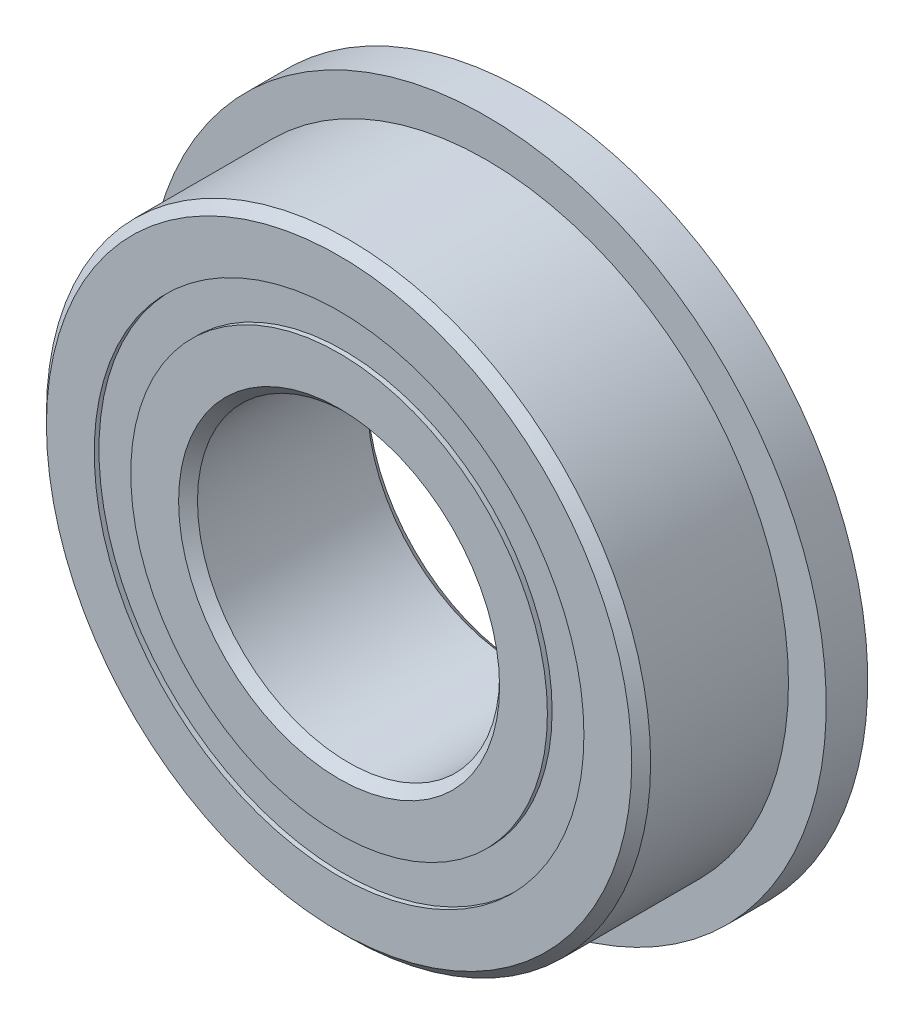
ISO-10303-21;
HEADER;
FILE_DESCRIPTION(('STEP AP214'),'2;1');
FILE_NAME('part.step','',(''),(''),'','','');
FILE_SCHEMA(('AUTOMOTIVE_DESIGN { 1 0 10303 214 1 1 1 1 }'));
ENDSEC;
DATA;
#1=APPLICATION_CONTEXT('core data for automotive mechanical design processes');
#2=APPLICATION_PROTOCOL_DEFINITION('international standard','automotive_design',2000,#1);
#3=PRODUCT_CONTEXT('',#1,'mechanical');
#4=PRODUCT('Part','Part','',(#3));
#5=PRODUCT_RELATED_PRODUCT_CATEGORY('part','',(#4));
#6=PRODUCT_DEFINITION_FORMATION('','',#4);
#7=PRODUCT_DEFINITION_CONTEXT('part definition',#1,'design');
#8=PRODUCT_DEFINITION('design','',#6,#7);
#9=PRODUCT_DEFINITION_SHAPE('','',#8);
#10=(LENGTH_UNIT() NAMED_UNIT(*) SI_UNIT(.MILLI.,.METRE.));
#11=(NAMED_UNIT(*) PLANE_ANGLE_UNIT() SI_UNIT($,.RADIAN.));
#12=(NAMED_UNIT(*) SI_UNIT($,.STERADIAN.) SOLID_ANGLE_UNIT());
#13=UNCERTAINTY_MEASURE_WITH_UNIT(LENGTH_MEASURE(1.E-05),#10,'distance_accuracy_value','');
#14=(GEOMETRIC_REPRESENTATION_CONTEXT(3) GLOBAL_UNCERTAINTY_ASSIGNED_CONTEXT((#13)) GLOBAL_UNIT_ASSIGNED_CONTEXT((#10,
#11,#12)) REPRESENTATION_CONTEXT('',''));
#15=CARTESIAN_POINT('',(0.,0.,0.));
#16=DIRECTION('',(0.,0.,1.));
#17=DIRECTION('',(1.,0.,0.));
#18=AXIS2_PLACEMENT_3D('',#15,#16,#17);
#19=CARTESIAN_POINT('',(0.,6.48351648351648,-2.375));
#20=DIRECTION('',(0.,0.,1.));
#21=DIRECTION('',(1.,0.,0.));
#22=AXIS2_PLACEMENT_3D('',#19,#20,#21);
#23=PLANE('',#22);
#24=CARTESIAN_POINT('',(0.,0.,-2.375));
#25=DIRECTION('',(0.,0.,1.));
#26=DIRECTION('',(1.,0.,0.));
#27=AXIS2_PLACEMENT_3D('',#24,#25,#26);
#28=CIRCLE('',#27,6.48351648351648);
#29=CARTESIAN_POINT('',(6.48351648351648,0.,-2.375));
#30=VERTEX_POINT('',#29);
#31=EDGE_CURVE('E66',#30,#30,#28,.T.);
#32=ORIENTED_EDGE('',*,*,#31,.F.);
#33=EDGE_LOOP('',(#32));
#34=FACE_BOUND('',#33,.T.);
#35=CARTESIAN_POINT('',(0.,0.,-2.375));
#36=DIRECTION('',(0.,0.,1.));
#37=DIRECTION('',(1.,0.,0.));
#38=AXIS2_PLACEMENT_3D('',#35,#36,#37);
#39=CIRCLE('',#38,5.51648351648352);
#40=CARTESIAN_POINT('',(5.51648351648352,0.,-2.375));
#41=VERTEX_POINT('',#40);
#42=EDGE_CURVE('E11',#41,#41,#39,.T.);
#43=ORIENTED_EDGE('',*,*,#42,.T.);
#44=EDGE_LOOP('',(#43));
#45=FACE_BOUND('',#44,.T.);
#46=ADVANCED_FACE('F48',(#34,#45),#23,.F.);
#47=CARTESIAN_POINT('',(0.,0.,2.5));
#48=DIRECTION('',(0.,0.,1.));
#49=DIRECTION('',(1.,0.,0.));
#50=AXIS2_PLACEMENT_3D('',#47,#48,#49);
#51=CYLINDRICAL_SURFACE('',#50,5.51648351648352);
#52=ORIENTED_EDGE('',*,*,#42,.F.);
#53=EDGE_LOOP('',(#52));
#54=FACE_BOUND('',#53,.T.);
#55=CARTESIAN_POINT('',(0.,0.,-1.21175743903915));
#56=DIRECTION('',(0.,0.,1.));
#57=DIRECTION('',(1.,0.,0.));
#58=AXIS2_PLACEMENT_3D('',#55,#56,#57);
#59=CIRCLE('',#58,5.51648351648352);
#60=CARTESIAN_POINT('',(5.51648351648352,0.,-1.21175743903915));
#61=VERTEX_POINT('',#60);
#62=EDGE_CURVE('E55',#61,#61,#59,.T.);
#63=ORIENTED_EDGE('',*,*,#62,.T.);
#64=EDGE_LOOP('',(#63));
#65=FACE_BOUND('',#64,.T.);
#66=ADVANCED_FACE('F75',(#54,#65),#51,.F.);
#67=CARTESIAN_POINT('',(0.,6.48351648351648,-1.21175743903915));
#68=DIRECTION('',(0.,0.,-1.));
#69=DIRECTION('',(-1.,0.,0.));
#70=AXIS2_PLACEMENT_3D('',#67,#68,#69);
#71=PLANE('',#70);
#72=ORIENTED_EDGE('',*,*,#62,.F.);
#73=EDGE_LOOP('',(#72));
#74=FACE_BOUND('',#73,.T.);
#75=CARTESIAN_POINT('',(0.,0.,-1.21175743903915));
#76=DIRECTION('',(0.,0.,1.));
#77=DIRECTION('',(1.,0.,0.));
#78=AXIS2_PLACEMENT_3D('',#75,#76,#77);
#79=CIRCLE('',#78,6.48351648351648);
#80=CARTESIAN_POINT('',(6.48351648351648,0.,-1.21175743903915));
#81=VERTEX_POINT('',#80);
#82=EDGE_CURVE('E62',#81,#81,#79,.T.);
#83=ORIENTED_EDGE('',*,*,#82,.T.);
#84=EDGE_LOOP('',(#83));
#85=FACE_BOUND('',#84,.T.);
#86=ADVANCED_FACE('F79',(#74,#85),#71,.F.);
#87=CARTESIAN_POINT('',(0.,0.,2.5));
#88=DIRECTION('',(0.,0.,1.));
#89=DIRECTION('',(1.,0.,0.));
#90=AXIS2_PLACEMENT_3D('',#87,#88,#89);
#91=CYLINDRICAL_SURFACE('',#90,6.48351648351648);
#92=ORIENTED_EDGE('',*,*,#82,.F.);
#93=EDGE_LOOP('',(#92));
#94=FACE_BOUND('',#93,.T.);
#95=ORIENTED_EDGE('',*,*,#31,.T.);
#96=EDGE_LOOP('',(#95));
#97=FACE_BOUND('',#96,.T.);
#98=ADVANCED_FACE('F72',(#94,#97),#91,.T.);
#99=CLOSED_SHELL('',(#46,#66,#86,#98));
#100=MANIFOLD_SOLID_BREP('B2',#99);
#101=CARTESIAN_POINT('',(0.,6.48351648351648,2.375));
#102=DIRECTION('',(0.,0.,-1.));
#103=DIRECTION('',(-1.,0.,0.));
#104=AXIS2_PLACEMENT_3D('',#101,#102,#103);
#105=PLANE('',#104);
#106=CARTESIAN_POINT('',(0.,0.,2.375));
#107=DIRECTION('',(0.,0.,1.));
#108=DIRECTION('',(1.,0.,0.));
#109=AXIS2_PLACEMENT_3D('',#106,#107,#108);
#110=CIRCLE('',#109,5.51648351648352);
#111=CARTESIAN_POINT('',(5.51648351648352,0.,2.375));
#112=VERTEX_POINT('',#111);
#113=EDGE_CURVE('E47',#112,#112,#110,.T.);
#114=ORIENTED_EDGE('',*,*,#113,.F.);
#115=EDGE_LOOP('',(#114));
#116=FACE_BOUND('',#115,.T.);
#117=CARTESIAN_POINT('',(0.,0.,2.375));
#118=DIRECTION('',(0.,0.,1.));
#119=DIRECTION('',(1.,0.,0.));
#120=AXIS2_PLACEMENT_3D('',#117,#118,#119);
#121=CIRCLE('',#120,6.48351648351648);
#122=CARTESIAN_POINT('',(6.48351648351648,0.,2.375));
#123=VERTEX_POINT('',#122);
#124=EDGE_CURVE('E142',#123,#123,#121,.T.);
#125=ORIENTED_EDGE('',*,*,#124,.T.);
#126=EDGE_LOOP('',(#125));
#127=FACE_BOUND('',#126,.T.);
#128=ADVANCED_FACE('F124',(#116,#127),#105,.F.);
#129=CARTESIAN_POINT('',(0.,0.,2.5));
#130=DIRECTION('',(0.,0.,1.));
#131=DIRECTION('',(1.,0.,0.));
#132=AXIS2_PLACEMENT_3D('',#129,#130,#131);
#133=CYLINDRICAL_SURFACE('',#132,5.51648351648352);
#134=CARTESIAN_POINT('',(0.,0.,1.21175743903915));
#135=DIRECTION('',(0.,0.,1.));
#136=DIRECTION('',(1.,0.,0.));
#137=AXIS2_PLACEMENT_3D('',#134,#135,#136);
#138=CIRCLE('',#137,5.51648351648352);
#139=CARTESIAN_POINT('',(5.51648351648352,0.,1.21175743903915));
#140=VERTEX_POINT('',#139);
#141=EDGE_CURVE('E131',#140,#140,#138,.T.);
#142=ORIENTED_EDGE('',*,*,#141,.F.);
#143=EDGE_LOOP('',(#142));
#144=FACE_BOUND('',#143,.T.);
#145=ORIENTED_EDGE('',*,*,#113,.T.);
#146=EDGE_LOOP('',(#145));
#147=FACE_BOUND('',#146,.T.);
#148=ADVANCED_FACE('F157',(#144,#147),#133,.F.);
#149=CARTESIAN_POINT('',(0.,6.48351648351648,1.21175743903915));
#150=DIRECTION('',(0.,0.,1.));
#151=DIRECTION('',(1.,0.,0.));
#152=AXIS2_PLACEMENT_3D('',#149,#150,#151);
#153=PLANE('',#152);
#154=CARTESIAN_POINT('',(0.,0.,1.21175743903915));
#155=DIRECTION('',(0.,0.,1.));
#156=DIRECTION('',(1.,0.,0.));
#157=AXIS2_PLACEMENT_3D('',#154,#155,#156);
#158=CIRCLE('',#157,6.48351648351648);
#159=CARTESIAN_POINT('',(6.48351648351648,0.,1.21175743903915));
#160=VERTEX_POINT('',#159);
#161=EDGE_CURVE('E137',#160,#160,#158,.T.);
#162=ORIENTED_EDGE('',*,*,#161,.F.);
#163=EDGE_LOOP('',(#162));
#164=FACE_BOUND('',#163,.T.);
#165=ORIENTED_EDGE('',*,*,#141,.T.);
#166=EDGE_LOOP('',(#165));
#167=FACE_BOUND('',#166,.T.);
#168=ADVANCED_FACE('F152',(#164,#167),#153,.F.);
#169=CARTESIAN_POINT('',(0.,0.,2.5));
#170=DIRECTION('',(0.,0.,1.));
#171=DIRECTION('',(1.,0.,0.));
#172=AXIS2_PLACEMENT_3D('',#169,#170,#171);
#173=CYLINDRICAL_SURFACE('',#172,6.48351648351648);
#174=ORIENTED_EDGE('',*,*,#124,.F.);
#175=EDGE_LOOP('',(#174));
#176=FACE_BOUND('',#175,.T.);
#177=ORIENTED_EDGE('',*,*,#161,.T.);
#178=EDGE_LOOP('',(#177));
#179=FACE_BOUND('',#178,.T.);
#180=ADVANCED_FACE('F149',(#176,#179),#173,.T.);
#181=CLOSED_SHELL('',(#128,#148,#168,#180));
#182=MANIFOLD_SOLID_BREP('B6',#181);
#183=CARTESIAN_POINT('',(-2.99999999999993,5.19615242270667,0.));
#184=DIRECTION('',(0.,0.,1.));
#185=DIRECTION('',(-0.499999999999989,0.866025403784445,0.));
#186=AXIS2_PLACEMENT_3D('',#183,#184,#185);
#187=SPHERICAL_SURFACE('',#186,1.21175743903915);
#188=CARTESIAN_POINT('',(-2.99999999999993,5.19615242270667,1.21175743903915));
#189=VERTEX_POINT('',#188);
#190=VERTEX_LOOP('',#189);
#191=FACE_BOUND('',#190,.T.);
#192=ADVANCED_FACE('F200',(#191),#187,.T.);
#193=CLOSED_SHELL('',(#192));
#194=MANIFOLD_SOLID_BREP('B42',#193);
#195=CARTESIAN_POINT('',(-5.1961524227066,3.00000000000006,0.));
#196=DIRECTION('',(0.,0.,1.));
#197=DIRECTION('',(-0.866025403784433,0.50000000000001,0.));
#198=AXIS2_PLACEMENT_3D('',#195,#196,#197);
#199=SPHERICAL_SURFACE('',#198,1.21175743903915);
#200=CARTESIAN_POINT('',(-5.1961524227066,3.00000000000006,1.21175743903915));
#201=VERTEX_POINT('',#200);
#202=VERTEX_LOOP('',#201);
#203=FACE_BOUND('',#202,.T.);
#204=ADVANCED_FACE('F222',(#203),#199,.T.);
#205=CLOSED_SHELL('',(#204));
#206=MANIFOLD_SOLID_BREP('B120',#205);
#207=CARTESIAN_POINT('',(-6.,0.,0.));
#208=DIRECTION('',(0.,0.,1.));
#209=DIRECTION('',(-1.,0.,0.));
#210=AXIS2_PLACEMENT_3D('',#207,#208,#209);
#211=SPHERICAL_SURFACE('',#210,1.21175743903915);
#212=CARTESIAN_POINT('',(-6.,0.,1.21175743903915));
#213=VERTEX_POINT('',#212);
#214=VERTEX_LOOP('',#213);
#215=FACE_BOUND('',#214,.T.);
#216=ADVANCED_FACE('F244',(#215),#211,.T.);
#217=CLOSED_SHELL('',(#216));
#218=MANIFOLD_SOLID_BREP('B196',#217);
#219=CARTESIAN_POINT('',(-5.19615242270666,-2.99999999999995,0.));
#220=DIRECTION('',(0.,0.,1.));
#221=DIRECTION('',(-0.866025403784443,-0.499999999999992,0.));
#222=AXIS2_PLACEMENT_3D('',#219,#220,#221);
#223=SPHERICAL_SURFACE('',#222,1.21175743903915);
#224=CARTESIAN_POINT('',(-5.19615242270666,-2.99999999999995,1.21175743903915));
#225=VERTEX_POINT('',#224);
#226=VERTEX_LOOP('',#225);
#227=FACE_BOUND('',#226,.T.);
#228=ADVANCED_FACE('F265',(#227),#223,.T.);
#229=CLOSED_SHELL('',(#228));
#230=MANIFOLD_SOLID_BREP('B218',#229);
#231=CARTESIAN_POINT('',(-3.00000000000004,-5.19615242270661,0.));
#232=DIRECTION('',(0.,0.,1.));
#233=DIRECTION('',(-0.500000000000007,-0.866025403784435,0.));
#234=AXIS2_PLACEMENT_3D('',#231,#232,#233);
#235=SPHERICAL_SURFACE('',#234,1.21175743903915);
#236=CARTESIAN_POINT('',(-3.00000000000004,-5.19615242270661,1.21175743903915));
#237=VERTEX_POINT('',#236);
#238=VERTEX_LOOP('',#237);
#239=FACE_BOUND('',#238,.T.);
#240=ADVANCED_FACE('F286',(#239),#235,.T.);
#241=CLOSED_SHELL('',(#240));
#242=MANIFOLD_SOLID_BREP('B240',#241);
#243=CARTESIAN_POINT('',(0.,-6.,0.));
#244=DIRECTION('',(0.,0.,1.));
#245=DIRECTION('',(0.,-1.,0.));
#246=AXIS2_PLACEMENT_3D('',#243,#244,#245);
#247=SPHERICAL_SURFACE('',#246,1.21175743903915);
#248=CARTESIAN_POINT('',(0.,-6.,1.21175743903915));
#249=VERTEX_POINT('',#248);
#250=VERTEX_LOOP('',#249);
#251=FACE_BOUND('',#250,.T.);
#252=ADVANCED_FACE('F307',(#251),#247,.T.);
#253=CLOSED_SHELL('',(#252));
#254=MANIFOLD_SOLID_BREP('B261',#253);
#255=CARTESIAN_POINT('',(2.99999999999997,-5.19615242270665,0.));
#256=DIRECTION('',(0.,0.,1.));
#257=DIRECTION('',(0.499999999999995,-0.866025403784442,0.));
#258=AXIS2_PLACEMENT_3D('',#255,#256,#257);
#259=SPHERICAL_SURFACE('',#258,1.21175743903915);
#260=CARTESIAN_POINT('',(2.99999999999997,-5.19615242270665,1.21175743903915));
#261=VERTEX_POINT('',#260);
#262=VERTEX_LOOP('',#261);
#263=FACE_BOUND('',#262,.T.);
#264=ADVANCED_FACE('F328',(#263),#259,.T.);
#265=CLOSED_SHELL('',(#264));
#266=MANIFOLD_SOLID_BREP('B282',#265);
#267=CARTESIAN_POINT('',(5.19615242270662,-3.00000000000002,0.));
#268=DIRECTION('',(0.,0.,1.));
#269=DIRECTION('',(0.866025403784436,-0.500000000000004,0.));
#270=AXIS2_PLACEMENT_3D('',#267,#268,#269);
#271=SPHERICAL_SURFACE('',#270,1.21175743903915);
#272=CARTESIAN_POINT('',(5.19615242270662,-3.00000000000002,1.21175743903915));
#273=VERTEX_POINT('',#272);
#274=VERTEX_LOOP('',#273);
#275=FACE_BOUND('',#274,.T.);
#276=ADVANCED_FACE('F349',(#275),#271,.T.);
#277=CLOSED_SHELL('',(#276));
#278=MANIFOLD_SOLID_BREP('B303',#277);
#279=CARTESIAN_POINT('',(6.,0.,0.));
#280=DIRECTION('',(0.,0.,1.));
#281=DIRECTION('',(1.,0.,0.));
#282=AXIS2_PLACEMENT_3D('',#279,#280,#281);
#283=SPHERICAL_SURFACE('',#282,1.21175743903915);
#284=CARTESIAN_POINT('',(6.,0.,1.21175743903915));
#285=VERTEX_POINT('',#284);
#286=VERTEX_LOOP('',#285);
#287=FACE_BOUND('',#286,.T.);
#288=ADVANCED_FACE('F371',(#287),#283,.T.);
#289=CLOSED_SHELL('',(#288));
#290=MANIFOLD_SOLID_BREP('B324',#289);
#291=CARTESIAN_POINT('',(5.19615242270664,2.99999999999999,0.));
#292=DIRECTION('',(0.,0.,1.));
#293=DIRECTION('',(0.86602540378444,0.499999999999998,0.));
#294=AXIS2_PLACEMENT_3D('',#291,#292,#293);
#295=SPHERICAL_SURFACE('',#294,1.21175743903915);
#296=CARTESIAN_POINT('',(5.19615242270664,2.99999999999999,1.21175743903915));
#297=VERTEX_POINT('',#296);
#298=VERTEX_LOOP('',#297);
#299=FACE_BOUND('',#298,.T.);
#300=ADVANCED_FACE('F393',(#299),#295,.T.);
#301=CLOSED_SHELL('',(#300));
#302=MANIFOLD_SOLID_BREP('B345',#301);
#303=CARTESIAN_POINT('',(3.00000000000001,5.19615242270663,0.));
#304=DIRECTION('',(0.,0.,1.));
#305=DIRECTION('',(0.500000000000001,0.866025403784438,0.));
#306=AXIS2_PLACEMENT_3D('',#303,#304,#305);
#307=SPHERICAL_SURFACE('',#306,1.21175743903915);
#308=CARTESIAN_POINT('',(3.00000000000001,5.19615242270663,1.21175743903915));
#309=VERTEX_POINT('',#308);
#310=VERTEX_LOOP('',#309);
#311=FACE_BOUND('',#310,.T.);
#312=ADVANCED_FACE('F414',(#311),#307,.T.);
#313=CLOSED_SHELL('',(#312));
#314=MANIFOLD_SOLID_BREP('B367',#313);
#315=CARTESIAN_POINT('',(0.,6.,0.));
#316=DIRECTION('',(0.,0.,1.));
#317=DIRECTION('',(0.,1.,0.));
#318=AXIS2_PLACEMENT_3D('',#315,#316,#317);
#319=SPHERICAL_SURFACE('',#318,1.21175743903915);
#320=CARTESIAN_POINT('',(0.,6.,1.21175743903915));
#321=VERTEX_POINT('',#320);
#322=VERTEX_LOOP('',#321);
#323=FACE_BOUND('',#322,.T.);
#324=ADVANCED_FACE('F437',(#323),#319,.T.);
#325=CLOSED_SHELL('',(#324));
#326=MANIFOLD_SOLID_BREP('B389',#325);
#327=CARTESIAN_POINT('',(0.,5.51648351648352,2.5));
#328=DIRECTION('',(0.,0.,-1.));
#329=DIRECTION('',(-1.,0.,0.));
#330=AXIS2_PLACEMENT_3D('',#327,#328,#329);
#331=PLANE('',#330);
#332=CARTESIAN_POINT('',(0.,0.,2.5));
#333=DIRECTION('',(0.,0.,1.));
#334=DIRECTION('',(1.,0.,0.));
#335=AXIS2_PLACEMENT_3D('',#332,#333,#334);
#336=CIRCLE('',#335,4.25);
#337=CARTESIAN_POINT('',(4.25,0.,2.5));
#338=VERTEX_POINT('',#337);
#339=EDGE_CURVE('E493',#338,#338,#336,.T.);
#340=ORIENTED_EDGE('',*,*,#339,.F.);
#341=EDGE_LOOP('',(#340));
#342=FACE_BOUND('',#341,.T.);
#343=CARTESIAN_POINT('',(0.,0.,2.5));
#344=DIRECTION('',(0.,0.,1.));
#345=DIRECTION('',(1.,0.,0.));
#346=AXIS2_PLACEMENT_3D('',#343,#344,#345);
#347=CIRCLE('',#346,5.51648351648352);
#348=CARTESIAN_POINT('',(5.51648351648352,0.,2.5));
#349=VERTEX_POINT('',#348);
#350=EDGE_CURVE('E436',#349,#349,#347,.T.);
#351=ORIENTED_EDGE('',*,*,#350,.T.);
#352=EDGE_LOOP('',(#351));
#353=FACE_BOUND('',#352,.T.);
#354=ADVANCED_FACE('F457',(#342,#353),#331,.F.);
#355=CARTESIAN_POINT('',(0.,0.,2.5));
#356=DIRECTION('',(0.,0.,1.));
#357=DIRECTION('',(1.,0.,0.));
#358=AXIS2_PLACEMENT_3D('',#355,#356,#357);
#359=CYLINDRICAL_SURFACE('',#358,5.51648351648352);
#360=ORIENTED_EDGE('',*,*,#350,.F.);
#361=EDGE_LOOP('',(#360));
#362=FACE_BOUND('',#361,.T.);
#363=CARTESIAN_POINT('',(0.,0.,1.11111111111111));
#364=DIRECTION('',(0.,0.,1.));
#365=DIRECTION('',(1.,0.,0.));
#366=AXIS2_PLACEMENT_3D('',#363,#364,#365);
#367=CIRCLE('',#366,5.51648351648352);
#368=CARTESIAN_POINT('',(5.51648351648352,0.,1.11111111111111));
#369=VERTEX_POINT('',#368);
#370=EDGE_CURVE('E464',#369,#369,#367,.T.);
#371=ORIENTED_EDGE('',*,*,#370,.T.);
#372=EDGE_LOOP('',(#371));
#373=FACE_BOUND('',#372,.T.);
#374=ADVANCED_FACE('F500',(#362,#373),#359,.T.);
#375=CARTESIAN_POINT('',(0.,0.,0.));
#376=DIRECTION('',(0.,0.,1.));
#377=DIRECTION('',(1.,0.,0.));
#378=AXIS2_PLACEMENT_3D('',#375,#376,#377);
#379=TOROIDAL_SURFACE('',#378,6.,1.21175743903915);
#380=ORIENTED_EDGE('',*,*,#370,.F.);
#381=EDGE_LOOP('',(#380));
#382=FACE_BOUND('',#381,.T.);
#383=CARTESIAN_POINT('',(0.,0.,-1.11111111111111));
#384=DIRECTION('',(0.,0.,1.));
#385=DIRECTION('',(1.,0.,0.));
#386=AXIS2_PLACEMENT_3D('',#383,#384,#385);
#387=CIRCLE('',#386,5.51648351648352);
#388=CARTESIAN_POINT('',(5.51648351648352,0.,-1.11111111111111));
#389=VERTEX_POINT('',#388);
#390=EDGE_CURVE('E471',#389,#389,#387,.T.);
#391=ORIENTED_EDGE('',*,*,#390,.T.);
#392=EDGE_LOOP('',(#391));
#393=FACE_BOUND('',#392,.T.);
#394=ADVANCED_FACE('F504',(#382,#393),#379,.F.);
#395=CARTESIAN_POINT('',(0.,0.,2.5));
#396=DIRECTION('',(0.,0.,1.));
#397=DIRECTION('',(1.,0.,0.));
#398=AXIS2_PLACEMENT_3D('',#395,#396,#397);
#399=CYLINDRICAL_SURFACE('',#398,5.51648351648352);
#400=ORIENTED_EDGE('',*,*,#390,.F.);
#401=EDGE_LOOP('',(#400));
#402=FACE_BOUND('',#401,.T.);
#403=CARTESIAN_POINT('',(0.,0.,-2.5));
#404=DIRECTION('',(0.,0.,1.));
#405=DIRECTION('',(1.,0.,0.));
#406=AXIS2_PLACEMENT_3D('',#403,#404,#405);
#407=CIRCLE('',#406,5.51648351648352);
#408=CARTESIAN_POINT('',(5.51648351648352,0.,-2.5));
#409=VERTEX_POINT('',#408);
#410=EDGE_CURVE('E477',#409,#409,#407,.T.);
#411=ORIENTED_EDGE('',*,*,#410,.T.);
#412=EDGE_LOOP('',(#411));
#413=FACE_BOUND('',#412,.T.);
#414=ADVANCED_FACE('F509',(#402,#413),#399,.T.);
#415=CARTESIAN_POINT('',(0.,4.25,-2.5));
#416=DIRECTION('',(0.,0.,1.));
#417=DIRECTION('',(1.,0.,0.));
#418=AXIS2_PLACEMENT_3D('',#415,#416,#417);
#419=PLANE('',#418);
#420=ORIENTED_EDGE('',*,*,#410,.F.);
#421=EDGE_LOOP('',(#420));
#422=FACE_BOUND('',#421,.T.);
#423=CARTESIAN_POINT('',(0.,0.,-2.5));
#424=DIRECTION('',(0.,0.,1.));
#425=DIRECTION('',(1.,0.,0.));
#426=AXIS2_PLACEMENT_3D('',#423,#424,#425);
#427=CIRCLE('',#426,4.25);
#428=CARTESIAN_POINT('',(4.25,0.,-2.5));
#429=VERTEX_POINT('',#428);
#430=EDGE_CURVE('E483',#429,#429,#427,.T.);
#431=ORIENTED_EDGE('',*,*,#430,.T.);
#432=EDGE_LOOP('',(#431));
#433=FACE_BOUND('',#432,.T.);
#434=ADVANCED_FACE('F515',(#422,#433),#419,.F.);
#435=CARTESIAN_POINT('',(0.,0.,-2.25));
#436=DIRECTION('',(0.,0.,-1.));
#437=DIRECTION('',(-1.,0.,0.));
#438=AXIS2_PLACEMENT_3D('',#435,#436,#437);
#439=CONICAL_SURFACE('',#438,4.,0.785398163397443);
#440=ORIENTED_EDGE('',*,*,#430,.F.);
#441=EDGE_LOOP('',(#440));
#442=FACE_BOUND('',#441,.T.);
#443=CARTESIAN_POINT('',(0.,0.,-2.25));
#444=DIRECTION('',(0.,0.,1.));
#445=DIRECTION('',(1.,0.,0.));
#446=AXIS2_PLACEMENT_3D('',#443,#444,#445);
#447=CIRCLE('',#446,4.);
#448=CARTESIAN_POINT('',(4.,0.,-2.25));
#449=VERTEX_POINT('',#448);
#450=EDGE_CURVE('E487',#449,#449,#447,.T.);
#451=ORIENTED_EDGE('',*,*,#450,.T.);
#452=EDGE_LOOP('',(#451));
#453=FACE_BOUND('',#452,.T.);
#454=ADVANCED_FACE('F519',(#442,#453),#439,.F.);
#455=CARTESIAN_POINT('',(0.,0.,2.5));
#456=DIRECTION('',(0.,0.,1.));
#457=DIRECTION('',(1.,0.,0.));
#458=AXIS2_PLACEMENT_3D('',#455,#456,#457);
#459=CYLINDRICAL_SURFACE('',#458,4.);
#460=ORIENTED_EDGE('',*,*,#450,.F.);
#461=EDGE_LOOP('',(#460));
#462=FACE_BOUND('',#461,.T.);
#463=CARTESIAN_POINT('',(0.,0.,2.25));
#464=DIRECTION('',(0.,0.,1.));
#465=DIRECTION('',(1.,0.,0.));
#466=AXIS2_PLACEMENT_3D('',#463,#464,#465);
#467=CIRCLE('',#466,4.);
#468=CARTESIAN_POINT('',(4.,0.,2.25));
#469=VERTEX_POINT('',#468);
#470=EDGE_CURVE('E490',#469,#469,#467,.T.);
#471=ORIENTED_EDGE('',*,*,#470,.T.);
#472=EDGE_LOOP('',(#471));
#473=FACE_BOUND('',#472,.T.);
#474=ADVANCED_FACE('F523',(#462,#473),#459,.F.);
#475=CARTESIAN_POINT('',(0.,0.,2.5));
#476=DIRECTION('',(0.,0.,1.));
#477=DIRECTION('',(1.,0.,0.));
#478=AXIS2_PLACEMENT_3D('',#475,#476,#477);
#479=CONICAL_SURFACE('',#478,4.25,0.785398163397455);
#480=ORIENTED_EDGE('',*,*,#470,.F.);
#481=EDGE_LOOP('',(#480));
#482=FACE_BOUND('',#481,.T.);
#483=ORIENTED_EDGE('',*,*,#339,.T.);
#484=EDGE_LOOP('',(#483));
#485=FACE_BOUND('',#484,.T.);
#486=ADVANCED_FACE('F497',(#482,#485),#479,.F.);
#487=CLOSED_SHELL('',(#354,#374,#394,#414,#434,#454,#474,#486));
#488=MANIFOLD_SOLID_BREP('B410',#487);
#489=CARTESIAN_POINT('',(0.,0.,2.25));
#490=DIRECTION('',(0.,0.,-1.));
#491=DIRECTION('',(-1.,0.,0.));
#492=AXIS2_PLACEMENT_3D('',#489,#490,#491);
#493=CONICAL_SURFACE('',#492,8.,0.785398163397446);
#494=CARTESIAN_POINT('',(0.,0.,2.5));
#495=DIRECTION('',(0.,0.,1.));
#496=DIRECTION('',(1.,0.,0.));
#497=AXIS2_PLACEMENT_3D('',#494,#495,#496);
#498=CIRCLE('',#497,7.75);
#499=CARTESIAN_POINT('',(7.75,0.,2.5));
#500=VERTEX_POINT('',#499);
#501=EDGE_CURVE('E622',#500,#500,#498,.T.);
#502=ORIENTED_EDGE('',*,*,#501,.F.);
#503=EDGE_LOOP('',(#502));
#504=FACE_BOUND('',#503,.T.);
#505=CARTESIAN_POINT('',(0.,0.,2.25));
#506=DIRECTION('',(0.,0.,1.));
#507=DIRECTION('',(1.,0.,0.));
#508=AXIS2_PLACEMENT_3D('',#505,#506,#507);
#509=CIRCLE('',#508,8.);
#510=CARTESIAN_POINT('',(8.,0.,2.25));
#511=VERTEX_POINT('',#510);
#512=EDGE_CURVE('E456',#511,#511,#509,.T.);
#513=ORIENTED_EDGE('',*,*,#512,.T.);
#514=EDGE_LOOP('',(#513));
#515=FACE_BOUND('',#514,.T.);
#516=ADVANCED_FACE('F594',(#504,#515),#493,.T.);
#517=CARTESIAN_POINT('',(0.,0.,2.5));
#518=DIRECTION('',(0.,0.,1.));
#519=DIRECTION('',(1.,0.,0.));
#520=AXIS2_PLACEMENT_3D('',#517,#518,#519);
#521=CYLINDRICAL_SURFACE('',#520,8.);
#522=CARTESIAN_POINT('',(0.,0.,-1.4));
#523=DIRECTION('',(0.,0.,1.));
#524=DIRECTION('',(1.,0.,0.));
#525=AXIS2_PLACEMENT_3D('',#522,#523,#524);
#526=CIRCLE('',#525,8.);
#527=CARTESIAN_POINT('',(8.,0.,-1.4));
#528=VERTEX_POINT('',#527);
#529=EDGE_CURVE('E626',#528,#528,#526,.T.);
#530=ORIENTED_EDGE('',*,*,#529,.T.);
#531=EDGE_LOOP('',(#530));
#532=FACE_BOUND('',#531,.T.);
#533=ORIENTED_EDGE('',*,*,#512,.F.);
#534=EDGE_LOOP('',(#533));
#535=FACE_BOUND('',#534,.T.);
#536=ADVANCED_FACE('F648',(#532,#535),#521,.T.);
#537=CARTESIAN_POINT('',(0.,7.75,-2.5));
#538=DIRECTION('',(0.,0.,1.));
#539=DIRECTION('',(1.,0.,0.));
#540=AXIS2_PLACEMENT_3D('',#537,#538,#539);
#541=PLANE('',#540);
#542=CARTESIAN_POINT('',(0.,0.,-2.5));
#543=DIRECTION('',(0.,0.,1.));
#544=DIRECTION('',(1.,0.,0.));
#545=AXIS2_PLACEMENT_3D('',#542,#543,#544);
#546=CIRCLE('',#545,6.48351648351648);
#547=CARTESIAN_POINT('',(6.48351648351648,0.,-2.5));
#548=VERTEX_POINT('',#547);
#549=EDGE_CURVE('E601',#548,#548,#546,.T.);
#550=ORIENTED_EDGE('',*,*,#549,.T.);
#551=EDGE_LOOP('',(#550));
#552=FACE_BOUND('',#551,.T.);
#553=CARTESIAN_POINT('',(0.,0.,-2.5));
#554=DIRECTION('',(0.,0.,-1.));
#555=DIRECTION('',(-1.,0.,0.));
#556=AXIS2_PLACEMENT_3D('',#553,#554,#555);
#557=CIRCLE('',#556,9.);
#558=CARTESIAN_POINT('',(-9.,0.,-2.5));
#559=VERTEX_POINT('',#558);
#560=EDGE_CURVE('E629',#559,#559,#557,.T.);
#561=ORIENTED_EDGE('',*,*,#560,.T.);
#562=EDGE_LOOP('',(#561));
#563=FACE_BOUND('',#562,.T.);
#564=ADVANCED_FACE('F651',(#552,#563),#541,.F.);
#565=CARTESIAN_POINT('',(0.,0.,2.5));
#566=DIRECTION('',(0.,0.,1.));
#567=DIRECTION('',(1.,0.,0.));
#568=AXIS2_PLACEMENT_3D('',#565,#566,#567);
#569=CYLINDRICAL_SURFACE('',#568,6.48351648351648);
#570=CARTESIAN_POINT('',(0.,0.,-1.11111111111111));
#571=DIRECTION('',(0.,0.,1.));
#572=DIRECTION('',(1.,0.,0.));
#573=AXIS2_PLACEMENT_3D('',#570,#571,#572);
#574=CIRCLE('',#573,6.48351648351648);
#575=CARTESIAN_POINT('',(6.48351648351648,0.,-1.11111111111111));
#576=VERTEX_POINT('',#575);
#577=EDGE_CURVE('E607',#576,#576,#574,.T.);
#578=ORIENTED_EDGE('',*,*,#577,.T.);
#579=EDGE_LOOP('',(#578));
#580=FACE_BOUND('',#579,.T.);
#581=ORIENTED_EDGE('',*,*,#549,.F.);
#582=EDGE_LOOP('',(#581));
#583=FACE_BOUND('',#582,.T.);
#584=ADVANCED_FACE('F656',(#580,#583),#569,.F.);
#585=CARTESIAN_POINT('',(0.,0.,0.));
#586=DIRECTION('',(0.,0.,1.));
#587=DIRECTION('',(1.,0.,0.));
#588=AXIS2_PLACEMENT_3D('',#585,#586,#587);
#589=TOROIDAL_SURFACE('',#588,6.,1.21175743903915);
#590=ORIENTED_EDGE('',*,*,#577,.F.);
#591=EDGE_LOOP('',(#590));
#592=FACE_BOUND('',#591,.T.);
#593=CARTESIAN_POINT('',(0.,0.,1.11111111111111));
#594=DIRECTION('',(0.,0.,1.));
#595=DIRECTION('',(1.,0.,0.));
#596=AXIS2_PLACEMENT_3D('',#593,#594,#595);
#597=CIRCLE('',#596,6.48351648351648);
#598=CARTESIAN_POINT('',(6.48351648351648,0.,1.11111111111111));
#599=VERTEX_POINT('',#598);
#600=EDGE_CURVE('E612',#599,#599,#597,.T.);
#601=ORIENTED_EDGE('',*,*,#600,.T.);
#602=EDGE_LOOP('',(#601));
#603=FACE_BOUND('',#602,.T.);
#604=ADVANCED_FACE('F662',(#592,#603),#589,.F.);
#605=CARTESIAN_POINT('',(0.,0.,2.5));
#606=DIRECTION('',(0.,0.,1.));
#607=DIRECTION('',(1.,0.,0.));
#608=AXIS2_PLACEMENT_3D('',#605,#606,#607);
#609=CYLINDRICAL_SURFACE('',#608,6.48351648351648);
#610=ORIENTED_EDGE('',*,*,#600,.F.);
#611=EDGE_LOOP('',(#610));
#612=FACE_BOUND('',#611,.T.);
#613=CARTESIAN_POINT('',(0.,0.,2.5));
#614=DIRECTION('',(0.,0.,1.));
#615=DIRECTION('',(1.,0.,0.));
#616=AXIS2_PLACEMENT_3D('',#613,#614,#615);
#617=CIRCLE('',#616,6.48351648351648);
#618=CARTESIAN_POINT('',(6.48351648351648,0.,2.5));
#619=VERTEX_POINT('',#618);
#620=EDGE_CURVE('E618',#619,#619,#617,.T.);
#621=ORIENTED_EDGE('',*,*,#620,.T.);
#622=EDGE_LOOP('',(#621));
#623=FACE_BOUND('',#622,.T.);
#624=ADVANCED_FACE('F666',(#612,#623),#609,.F.);
#625=CARTESIAN_POINT('',(0.,7.75,2.5));
#626=DIRECTION('',(0.,0.,-1.));
#627=DIRECTION('',(-1.,0.,0.));
#628=AXIS2_PLACEMENT_3D('',#625,#626,#627);
#629=PLANE('',#628);
#630=ORIENTED_EDGE('',*,*,#620,.F.);
#631=EDGE_LOOP('',(#630));
#632=FACE_BOUND('',#631,.T.);
#633=ORIENTED_EDGE('',*,*,#501,.T.);
#634=EDGE_LOOP('',(#633));
#635=FACE_BOUND('',#634,.T.);
#636=ADVANCED_FACE('F644',(#632,#635),#629,.F.);
#637=CARTESIAN_POINT('',(0.,6.48351648351648,-1.4));
#638=DIRECTION('',(0.,0.,1.));
#639=DIRECTION('',(1.,0.,0.));
#640=AXIS2_PLACEMENT_3D('',#637,#638,#639);
#641=PLANE('',#640);
#642=CARTESIAN_POINT('',(0.,0.,-1.4));
#643=DIRECTION('',(0.,0.,-1.));
#644=DIRECTION('',(-1.,0.,0.));
#645=AXIS2_PLACEMENT_3D('',#642,#643,#644);
#646=CIRCLE('',#645,9.);
#647=CARTESIAN_POINT('',(-9.,0.,-1.4));
#648=VERTEX_POINT('',#647);
#649=EDGE_CURVE('E633',#648,#648,#646,.T.);
#650=ORIENTED_EDGE('',*,*,#649,.F.);
#651=EDGE_LOOP('',(#650));
#652=FACE_BOUND('',#651,.T.);
#653=ORIENTED_EDGE('',*,*,#529,.F.);
#654=EDGE_LOOP('',(#653));
#655=FACE_BOUND('',#654,.T.);
#656=ADVANCED_FACE('F641',(#652,#655),#641,.T.);
#657=CARTESIAN_POINT('',(0.,0.,-2.5));
#658=DIRECTION('',(0.,0.,-1.));
#659=DIRECTION('',(-1.,0.,0.));
#660=AXIS2_PLACEMENT_3D('',#657,#658,#659);
#661=CYLINDRICAL_SURFACE('',#660,9.);
#662=ORIENTED_EDGE('',*,*,#649,.T.);
#663=EDGE_LOOP('',(#662));
#664=FACE_BOUND('',#663,.T.);
#665=ORIENTED_EDGE('',*,*,#560,.F.);
#666=EDGE_LOOP('',(#665));
#667=FACE_BOUND('',#666,.T.);
#668=ADVANCED_FACE('F638',(#664,#667),#661,.T.);
#669=CLOSED_SHELL('',(#516,#536,#564,#584,#604,#624,#636,#656,#668));
#670=MANIFOLD_SOLID_BREP('B431',#669);
#671=ADVANCED_BREP_SHAPE_REPRESENTATION('',(#18,#100,#182,#194,#206,#218,#230,#242,#254,#266,
#278,#290,#302,#314,#326,#488,#670),#14);
#672=SHAPE_DEFINITION_REPRESENTATION(#9,#671);
ENDSEC;
END-ISO-10303-21;
